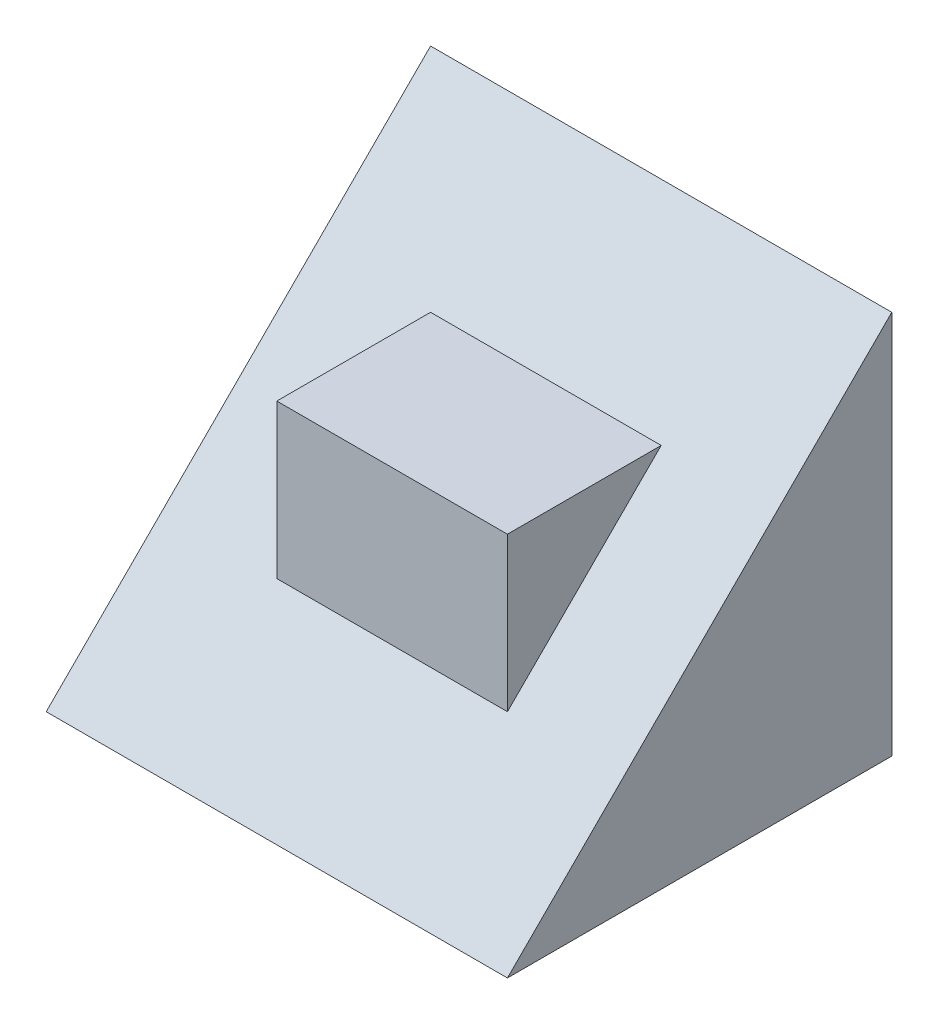
ISO-10303-21;
HEADER;
FILE_DESCRIPTION(('STEP AP214'),'2;1');
FILE_NAME('part.step','',(''),(''),'','','');
FILE_SCHEMA(('AUTOMOTIVE_DESIGN { 1 0 10303 214 1 1 1 1 }'));
ENDSEC;
DATA;
#1=APPLICATION_CONTEXT('core data for automotive mechanical design processes');
#2=APPLICATION_PROTOCOL_DEFINITION('international standard','automotive_design',2000,#1);
#3=PRODUCT_CONTEXT('',#1,'mechanical');
#4=PRODUCT('Part','Part','',(#3));
#5=PRODUCT_RELATED_PRODUCT_CATEGORY('part','',(#4));
#6=PRODUCT_DEFINITION_FORMATION('','',#4);
#7=PRODUCT_DEFINITION_CONTEXT('part definition',#1,'design');
#8=PRODUCT_DEFINITION('design','',#6,#7);
#9=PRODUCT_DEFINITION_SHAPE('','',#8);
#10=(LENGTH_UNIT() NAMED_UNIT(*) SI_UNIT(.MILLI.,.METRE.));
#11=(NAMED_UNIT(*) PLANE_ANGLE_UNIT() SI_UNIT($,.RADIAN.));
#12=(NAMED_UNIT(*) SI_UNIT($,.STERADIAN.) SOLID_ANGLE_UNIT());
#13=UNCERTAINTY_MEASURE_WITH_UNIT(LENGTH_MEASURE(1.E-05),#10,'distance_accuracy_value','');
#14=(GEOMETRIC_REPRESENTATION_CONTEXT(3) GLOBAL_UNCERTAINTY_ASSIGNED_CONTEXT((#13)) GLOBAL_UNIT_ASSIGNED_CONTEXT((#10,
#11,#12)) REPRESENTATION_CONTEXT('',''));
#15=CARTESIAN_POINT('',(0.,0.,0.));
#16=DIRECTION('',(0.,0.,1.));
#17=DIRECTION('',(1.,0.,0.));
#18=AXIS2_PLACEMENT_3D('',#15,#16,#17);
#19=CARTESIAN_POINT('',(30.,0.,50.));
#20=DIRECTION('',(0.,1.,0.));
#21=DIRECTION('',(0.,0.,1.));
#22=AXIS2_PLACEMENT_3D('',#19,#20,#21);
#23=PLANE('',#22);
#24=DIRECTION('',(0.,0.,-1.));
#25=VECTOR('',#24,1.);
#26=CARTESIAN_POINT('',(-30.,0.,50.));
#27=LINE('',#26,#25);
#28=CARTESIAN_POINT('',(-30.,0.,50.));
#29=VERTEX_POINT('',#28);
#30=CARTESIAN_POINT('',(-30.,0.,0.));
#31=VERTEX_POINT('',#30);
#32=EDGE_CURVE('E94',#29,#31,#27,.T.);
#33=ORIENTED_EDGE('',*,*,#32,.T.);
#34=DIRECTION('',(-1.,0.,0.));
#35=VECTOR('',#34,1.);
#36=CARTESIAN_POINT('',(30.,0.,0.));
#37=LINE('',#36,#35);
#38=CARTESIAN_POINT('',(30.,0.,0.));
#39=VERTEX_POINT('',#38);
#40=EDGE_CURVE('E121',#39,#31,#37,.T.);
#41=ORIENTED_EDGE('',*,*,#40,.F.);
#42=DIRECTION('',(0.,0.,-1.));
#43=VECTOR('',#42,1.);
#44=CARTESIAN_POINT('',(30.,0.,50.));
#45=LINE('',#44,#43);
#46=CARTESIAN_POINT('',(30.,0.,50.));
#47=VERTEX_POINT('',#46);
#48=EDGE_CURVE('E102',#47,#39,#45,.T.);
#49=ORIENTED_EDGE('',*,*,#48,.F.);
#50=DIRECTION('',(-1.,0.,0.));
#51=VECTOR('',#50,1.);
#52=CARTESIAN_POINT('',(30.,0.,50.));
#53=LINE('',#52,#51);
#54=EDGE_CURVE('E110',#47,#29,#53,.T.);
#55=ORIENTED_EDGE('',*,*,#54,.T.);
#56=EDGE_LOOP('',(#33,#41,#49,#55));
#57=FACE_BOUND('',#56,.T.);
#58=ADVANCED_FACE('F31',(#57),#23,.F.);
#59=CARTESIAN_POINT('',(30.,0.,0.));
#60=DIRECTION('',(0.,0.,1.));
#61=DIRECTION('',(1.,0.,0.));
#62=AXIS2_PLACEMENT_3D('',#59,#60,#61);
#63=PLANE('',#62);
#64=ORIENTED_EDGE('',*,*,#40,.T.);
#65=DIRECTION('',(0.,1.,0.));
#66=VECTOR('',#65,1.);
#67=CARTESIAN_POINT('',(-30.,0.,0.));
#68=LINE('',#67,#66);
#69=CARTESIAN_POINT('',(-30.,50.,0.));
#70=VERTEX_POINT('',#69);
#71=EDGE_CURVE('E113',#31,#70,#68,.T.);
#72=ORIENTED_EDGE('',*,*,#71,.T.);
#73=DIRECTION('',(-1.,0.,0.));
#74=VECTOR('',#73,1.);
#75=CARTESIAN_POINT('',(30.,50.,0.));
#76=LINE('',#75,#74);
#77=CARTESIAN_POINT('',(30.,50.,0.));
#78=VERTEX_POINT('',#77);
#79=EDGE_CURVE('E118',#78,#70,#76,.T.);
#80=ORIENTED_EDGE('',*,*,#79,.F.);
#81=DIRECTION('',(0.,1.,0.));
#82=VECTOR('',#81,1.);
#83=CARTESIAN_POINT('',(30.,0.,0.));
#84=LINE('',#83,#82);
#85=EDGE_CURVE('E105',#39,#78,#84,.T.);
#86=ORIENTED_EDGE('',*,*,#85,.F.);
#87=EDGE_LOOP('',(#64,#72,#80,#86));
#88=FACE_BOUND('',#87,.T.);
#89=ADVANCED_FACE('F132',(#88),#63,.F.);
#90=CARTESIAN_POINT('',(30.,50.,0.));
#91=DIRECTION('',(0.,-0.707106781186548,-0.707106781186548));
#92=DIRECTION('',(0.,0.707106781186548,-0.707106781186548));
#93=AXIS2_PLACEMENT_3D('',#90,#91,#92);
#94=PLANE('',#93);
#95=DIRECTION('',(-1.,0.,0.));
#96=VECTOR('',#95,1.);
#97=CARTESIAN_POINT('',(30.,35.,15.));
#98=LINE('',#97,#96);
#99=CARTESIAN_POINT('',(15.,35.,15.));
#100=VERTEX_POINT('',#99);
#101=CARTESIAN_POINT('',(-15.,35.,15.));
#102=VERTEX_POINT('',#101);
#103=EDGE_CURVE('E38',#100,#102,#98,.T.);
#104=ORIENTED_EDGE('',*,*,#103,.F.);
#105=DIRECTION('',(0.,-0.707106781186548,0.707106781186548));
#106=VECTOR('',#105,1.);
#107=CARTESIAN_POINT('',(15.,50.,0.));
#108=LINE('',#107,#106);
#109=CARTESIAN_POINT('',(15.,15.,35.));
#110=VERTEX_POINT('',#109);
#111=EDGE_CURVE('E11',#100,#110,#108,.T.);
#112=ORIENTED_EDGE('',*,*,#111,.T.);
#113=DIRECTION('',(1.,0.,0.));
#114=VECTOR('',#113,1.);
#115=CARTESIAN_POINT('',(30.,15.,35.));
#116=LINE('',#115,#114);
#117=CARTESIAN_POINT('',(-15.,15.,35.));
#118=VERTEX_POINT('',#117);
#119=EDGE_CURVE('E97',#118,#110,#116,.T.);
#120=ORIENTED_EDGE('',*,*,#119,.F.);
#121=DIRECTION('',(0.,-0.707106781186548,0.707106781186548));
#122=VECTOR('',#121,1.);
#123=CARTESIAN_POINT('',(-15.,50.,0.));
#124=LINE('',#123,#122);
#125=EDGE_CURVE('E123',#102,#118,#124,.T.);
#126=ORIENTED_EDGE('',*,*,#125,.F.);
#127=EDGE_LOOP('',(#104,#112,#120,#126));
#128=FACE_BOUND('',#127,.T.);
#129=DIRECTION('',(0.,-0.707106781186548,0.707106781186548));
#130=VECTOR('',#129,1.);
#131=CARTESIAN_POINT('',(-30.,50.,0.));
#132=LINE('',#131,#130);
#133=EDGE_CURVE('E106',#70,#29,#132,.T.);
#134=ORIENTED_EDGE('',*,*,#133,.T.);
#135=ORIENTED_EDGE('',*,*,#54,.F.);
#136=DIRECTION('',(0.,-0.707106781186548,0.707106781186548));
#137=VECTOR('',#136,1.);
#138=CARTESIAN_POINT('',(30.,50.,0.));
#139=LINE('',#138,#137);
#140=EDGE_CURVE('E108',#78,#47,#139,.T.);
#141=ORIENTED_EDGE('',*,*,#140,.F.);
#142=ORIENTED_EDGE('',*,*,#79,.T.);
#143=EDGE_LOOP('',(#134,#135,#141,#142));
#144=FACE_BOUND('',#143,.T.);
#145=ADVANCED_FACE('F128',(#128,#144),#94,.F.);
#146=CARTESIAN_POINT('',(30.,0.,0.));
#147=DIRECTION('',(1.,0.,0.));
#148=DIRECTION('',(0.,0.,-1.));
#149=AXIS2_PLACEMENT_3D('',#146,#147,#148);
#150=PLANE('',#149);
#151=ORIENTED_EDGE('',*,*,#48,.T.);
#152=ORIENTED_EDGE('',*,*,#85,.T.);
#153=ORIENTED_EDGE('',*,*,#140,.T.);
#154=EDGE_LOOP('',(#151,#152,#153));
#155=FACE_BOUND('',#154,.T.);
#156=ADVANCED_FACE('F131',(#155),#150,.T.);
#157=CARTESIAN_POINT('',(-30.,0.,0.));
#158=DIRECTION('',(1.,0.,0.));
#159=DIRECTION('',(0.,0.,-1.));
#160=AXIS2_PLACEMENT_3D('',#157,#158,#159);
#161=PLANE('',#160);
#162=ORIENTED_EDGE('',*,*,#32,.F.);
#163=ORIENTED_EDGE('',*,*,#133,.F.);
#164=ORIENTED_EDGE('',*,*,#71,.F.);
#165=EDGE_LOOP('',(#162,#163,#164));
#166=FACE_BOUND('',#165,.T.);
#167=ADVANCED_FACE('F144',(#166),#161,.F.);
#168=CARTESIAN_POINT('',(15.,35.,0.));
#169=DIRECTION('',(0.,-1.,0.));
#170=DIRECTION('',(0.,0.,-1.));
#171=AXIS2_PLACEMENT_3D('',#168,#169,#170);
#172=PLANE('',#171);
#173=DIRECTION('',(0.,0.,1.));
#174=VECTOR('',#173,1.);
#175=CARTESIAN_POINT('',(15.,35.,0.));
#176=LINE('',#175,#174);
#177=CARTESIAN_POINT('',(15.,35.,35.));
#178=VERTEX_POINT('',#177);
#179=EDGE_CURVE('E78',#100,#178,#176,.T.);
#180=ORIENTED_EDGE('',*,*,#179,.F.);
#181=ORIENTED_EDGE('',*,*,#103,.T.);
#182=DIRECTION('',(0.,0.,1.));
#183=VECTOR('',#182,1.);
#184=CARTESIAN_POINT('',(-15.,35.,0.));
#185=LINE('',#184,#183);
#186=CARTESIAN_POINT('',(-15.,35.,35.));
#187=VERTEX_POINT('',#186);
#188=EDGE_CURVE('E90',#102,#187,#185,.T.);
#189=ORIENTED_EDGE('',*,*,#188,.T.);
#190=DIRECTION('',(-1.,0.,0.));
#191=VECTOR('',#190,1.);
#192=CARTESIAN_POINT('',(15.,35.,35.));
#193=LINE('',#192,#191);
#194=EDGE_CURVE('E87',#178,#187,#193,.T.);
#195=ORIENTED_EDGE('',*,*,#194,.F.);
#196=EDGE_LOOP('',(#180,#181,#189,#195));
#197=FACE_BOUND('',#196,.T.);
#198=ADVANCED_FACE('F88',(#197),#172,.F.);
#199=CARTESIAN_POINT('',(15.,0.,35.));
#200=DIRECTION('',(0.,0.,-1.));
#201=DIRECTION('',(-1.,0.,0.));
#202=AXIS2_PLACEMENT_3D('',#199,#200,#201);
#203=PLANE('',#202);
#204=DIRECTION('',(0.,-1.,0.));
#205=VECTOR('',#204,1.);
#206=CARTESIAN_POINT('',(-15.,0.,35.));
#207=LINE('',#206,#205);
#208=EDGE_CURVE('E84',#187,#118,#207,.T.);
#209=ORIENTED_EDGE('',*,*,#208,.T.);
#210=ORIENTED_EDGE('',*,*,#119,.T.);
#211=DIRECTION('',(0.,-1.,0.));
#212=VECTOR('',#211,1.);
#213=CARTESIAN_POINT('',(15.,0.,35.));
#214=LINE('',#213,#212);
#215=EDGE_CURVE('E82',#178,#110,#214,.T.);
#216=ORIENTED_EDGE('',*,*,#215,.F.);
#217=ORIENTED_EDGE('',*,*,#194,.T.);
#218=EDGE_LOOP('',(#209,#210,#216,#217));
#219=FACE_BOUND('',#218,.T.);
#220=ADVANCED_FACE('F96',(#219),#203,.F.);
#221=CARTESIAN_POINT('',(15.,35.,0.));
#222=DIRECTION('',(1.,0.,0.));
#223=DIRECTION('',(0.,0.,-1.));
#224=AXIS2_PLACEMENT_3D('',#221,#222,#223);
#225=PLANE('',#224);
#226=ORIENTED_EDGE('',*,*,#111,.F.);
#227=ORIENTED_EDGE('',*,*,#179,.T.);
#228=ORIENTED_EDGE('',*,*,#215,.T.);
#229=EDGE_LOOP('',(#226,#227,#228));
#230=FACE_BOUND('',#229,.T.);
#231=ADVANCED_FACE('F80',(#230),#225,.T.);
#232=CARTESIAN_POINT('',(-15.,35.,0.));
#233=DIRECTION('',(1.,0.,0.));
#234=DIRECTION('',(0.,0.,-1.));
#235=AXIS2_PLACEMENT_3D('',#232,#233,#234);
#236=PLANE('',#235);
#237=ORIENTED_EDGE('',*,*,#188,.F.);
#238=ORIENTED_EDGE('',*,*,#125,.T.);
#239=ORIENTED_EDGE('',*,*,#208,.F.);
#240=EDGE_LOOP('',(#237,#238,#239));
#241=FACE_BOUND('',#240,.T.);
#242=ADVANCED_FACE('F127',(#241),#236,.F.);
#243=CLOSED_SHELL('',(#58,#89,#145,#156,#167,#198,#220,#231,#242));
#244=MANIFOLD_SOLID_BREP('B2',#243);
#245=ADVANCED_BREP_SHAPE_REPRESENTATION('',(#18,#244),#14);
#246=SHAPE_DEFINITION_REPRESENTATION(#9,#245);
ENDSEC;
END-ISO-10303-21;
